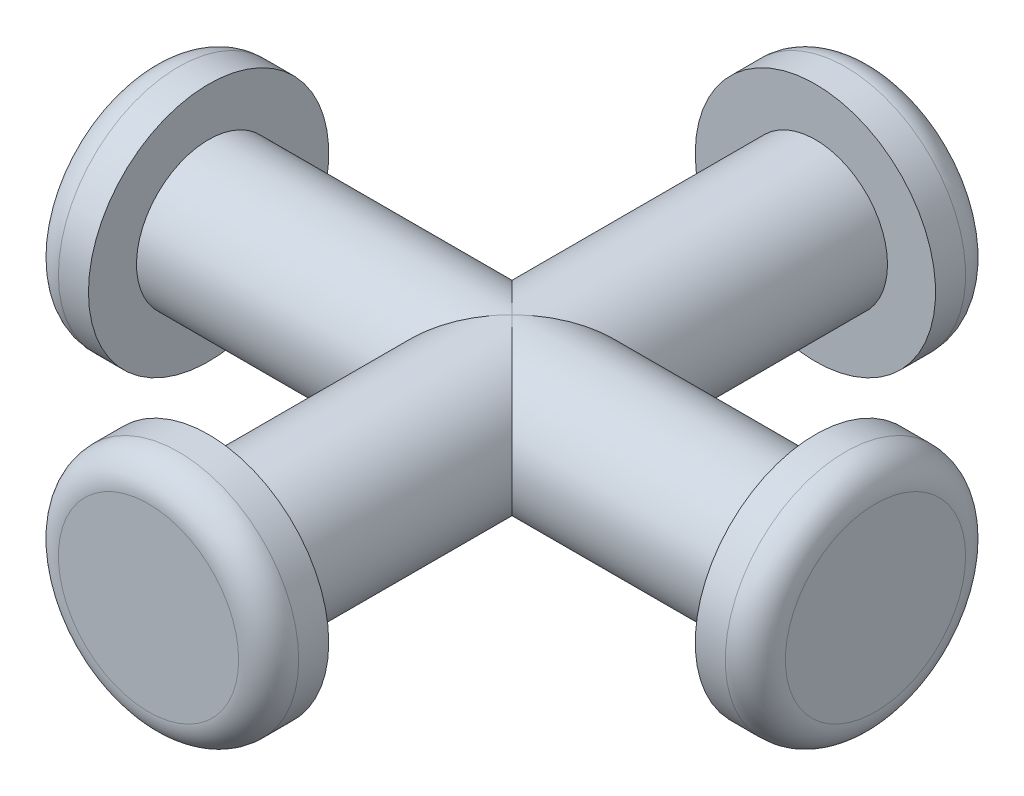
ISO-10303-21;
HEADER;
FILE_DESCRIPTION(('STEP AP214'),'2;1');
FILE_NAME('part.step','',(''),(''),'','','');
FILE_SCHEMA(('AUTOMOTIVE_DESIGN { 1 0 10303 214 1 1 1 1 }'));
ENDSEC;
DATA;
#1=APPLICATION_CONTEXT('core data for automotive mechanical design processes');
#2=APPLICATION_PROTOCOL_DEFINITION('international standard','automotive_design',2000,#1);
#3=PRODUCT_CONTEXT('',#1,'mechanical');
#4=PRODUCT('Part','Part','',(#3));
#5=PRODUCT_RELATED_PRODUCT_CATEGORY('part','',(#4));
#6=PRODUCT_DEFINITION_FORMATION('','',#4);
#7=PRODUCT_DEFINITION_CONTEXT('part definition',#1,'design');
#8=PRODUCT_DEFINITION('design','',#6,#7);
#9=PRODUCT_DEFINITION_SHAPE('','',#8);
#10=(LENGTH_UNIT() NAMED_UNIT(*) SI_UNIT(.MILLI.,.METRE.));
#11=(NAMED_UNIT(*) PLANE_ANGLE_UNIT() SI_UNIT($,.RADIAN.));
#12=(NAMED_UNIT(*) SI_UNIT($,.STERADIAN.) SOLID_ANGLE_UNIT());
#13=UNCERTAINTY_MEASURE_WITH_UNIT(LENGTH_MEASURE(1.E-05),#10,'distance_accuracy_value','');
#14=(GEOMETRIC_REPRESENTATION_CONTEXT(3) GLOBAL_UNCERTAINTY_ASSIGNED_CONTEXT((#13)) GLOBAL_UNIT_ASSIGNED_CONTEXT((#10,
#11,#12)) REPRESENTATION_CONTEXT('',''));
#15=CARTESIAN_POINT('',(0.,0.,0.));
#16=DIRECTION('',(0.,0.,1.));
#17=DIRECTION('',(1.,0.,0.));
#18=AXIS2_PLACEMENT_3D('',#15,#16,#17);
#19=CARTESIAN_POINT('',(0.,0.,10.1));
#20=DIRECTION('',(0.,0.,-1.));
#21=DIRECTION('',(-1.,0.,0.));
#22=AXIS2_PLACEMENT_3D('',#19,#20,#21);
#23=CYLINDRICAL_SURFACE('',#22,2.4);
#24=CARTESIAN_POINT('',(0.,0.,10.1));
#25=DIRECTION('',(0.,0.,1.));
#26=DIRECTION('',(1.,0.,0.));
#27=AXIS2_PLACEMENT_3D('',#24,#25,#26);
#28=CIRCLE('',#27,2.4);
#29=CARTESIAN_POINT('',(2.4,0.,10.1));
#30=VERTEX_POINT('',#29);
#31=EDGE_CURVE('E63',#30,#30,#28,.T.);
#32=ORIENTED_EDGE('',*,*,#31,.F.);
#33=EDGE_LOOP('',(#32));
#34=FACE_BOUND('',#33,.T.);
#35=CARTESIAN_POINT('',(0.,0.,0.));
#36=DIRECTION('',(-0.707106781186547,0.,-0.707106781186547));
#37=DIRECTION('',(0.707106781186547,0.,-0.707106781186547));
#38=AXIS2_PLACEMENT_3D('',#35,#36,#37);
#39=ELLIPSE('',#38,3.39411254969543,2.4);
#40=CARTESIAN_POINT('',(0.,-2.4,0.));
#41=VERTEX_POINT('',#40);
#42=CARTESIAN_POINT('',(0.,2.4,0.));
#43=VERTEX_POINT('',#42);
#44=EDGE_CURVE('E56',#41,#43,#39,.T.);
#45=ORIENTED_EDGE('',*,*,#44,.F.);
#46=CARTESIAN_POINT('',(0.,0.,0.));
#47=DIRECTION('',(0.707106781186547,0.,-0.707106781186547));
#48=DIRECTION('',(-0.707106781186547,0.,-0.707106781186547));
#49=AXIS2_PLACEMENT_3D('',#46,#47,#48);
#50=ELLIPSE('',#49,3.39411254969543,2.4);
#51=EDGE_CURVE('E55',#43,#41,#50,.T.);
#52=ORIENTED_EDGE('',*,*,#51,.F.);
#53=EDGE_LOOP('',(#45,#52));
#54=FACE_BOUND('',#53,.T.);
#55=ADVANCED_FACE('F35',(#34,#54),#23,.T.);
#56=CARTESIAN_POINT('',(10.1,0.,0.));
#57=DIRECTION('',(-1.,0.,0.));
#58=DIRECTION('',(0.,0.,1.));
#59=AXIS2_PLACEMENT_3D('',#56,#57,#58);
#60=CYLINDRICAL_SURFACE('',#59,2.4);
#61=CARTESIAN_POINT('',(-10.1,0.,0.));
#62=DIRECTION('',(1.,0.,0.));
#63=DIRECTION('',(0.,0.,-1.));
#64=AXIS2_PLACEMENT_3D('',#61,#62,#63);
#65=CIRCLE('',#64,2.4);
#66=CARTESIAN_POINT('',(-10.1,0.,-2.4));
#67=VERTEX_POINT('',#66);
#68=EDGE_CURVE('E134',#67,#67,#65,.T.);
#69=ORIENTED_EDGE('',*,*,#68,.T.);
#70=EDGE_LOOP('',(#69));
#71=FACE_BOUND('',#70,.T.);
#72=CARTESIAN_POINT('',(0.,0.,0.));
#73=DIRECTION('',(0.707106781186547,0.,-0.707106781186547));
#74=DIRECTION('',(-0.707106781186547,0.,-0.707106781186547));
#75=AXIS2_PLACEMENT_3D('',#72,#73,#74);
#76=ELLIPSE('',#75,3.39411254969543,2.4);
#77=EDGE_CURVE('E49',#43,#41,#76,.F.);
#78=ORIENTED_EDGE('',*,*,#77,.T.);
#79=ORIENTED_EDGE('',*,*,#44,.T.);
#80=EDGE_LOOP('',(#78,#79));
#81=FACE_BOUND('',#80,.T.);
#82=ADVANCED_FACE('F65',(#71,#81),#60,.T.);
#83=CARTESIAN_POINT('',(0.,0.,-10.1));
#84=DIRECTION('',(0.,0.,1.));
#85=DIRECTION('',(1.,0.,0.));
#86=AXIS2_PLACEMENT_3D('',#83,#84,#85);
#87=CIRCLE('',#86,2.4);
#88=CARTESIAN_POINT('',(2.4,0.,-10.1));
#89=VERTEX_POINT('',#88);
#90=EDGE_CURVE('E120',#89,#89,#87,.T.);
#91=ORIENTED_EDGE('',*,*,#90,.T.);
#92=EDGE_LOOP('',(#91));
#93=FACE_BOUND('',#92,.T.);
#94=CARTESIAN_POINT('',(0.,0.,0.));
#95=DIRECTION('',(-0.707106781186547,0.,-0.707106781186547));
#96=DIRECTION('',(0.707106781186547,0.,-0.707106781186547));
#97=AXIS2_PLACEMENT_3D('',#94,#95,#96);
#98=ELLIPSE('',#97,3.39411254969543,2.4);
#99=EDGE_CURVE('E62',#41,#43,#98,.F.);
#100=ORIENTED_EDGE('',*,*,#99,.F.);
#101=ORIENTED_EDGE('',*,*,#77,.F.);
#102=EDGE_LOOP('',(#100,#101));
#103=FACE_BOUND('',#102,.T.);
#104=ADVANCED_FACE('F61',(#93,#103),#23,.T.);
#105=CARTESIAN_POINT('',(10.1,0.,0.));
#106=DIRECTION('',(1.,0.,0.));
#107=DIRECTION('',(0.,0.,-1.));
#108=AXIS2_PLACEMENT_3D('',#105,#106,#107);
#109=CIRCLE('',#108,2.4);
#110=CARTESIAN_POINT('',(10.1,0.,-2.4));
#111=VERTEX_POINT('',#110);
#112=EDGE_CURVE('E133',#111,#111,#109,.T.);
#113=ORIENTED_EDGE('',*,*,#112,.F.);
#114=EDGE_LOOP('',(#113));
#115=FACE_BOUND('',#114,.T.);
#116=ORIENTED_EDGE('',*,*,#51,.T.);
#117=ORIENTED_EDGE('',*,*,#99,.T.);
#118=EDGE_LOOP('',(#116,#117));
#119=FACE_BOUND('',#118,.T.);
#120=ADVANCED_FACE('F67',(#115,#119),#60,.T.);
#121=CARTESIAN_POINT('',(12.1,0.,0.));
#122=DIRECTION('',(-1.,0.,0.));
#123=DIRECTION('',(0.,0.,1.));
#124=AXIS2_PLACEMENT_3D('',#121,#122,#123);
#125=CYLINDRICAL_SURFACE('',#124,4.);
#126=CARTESIAN_POINT('',(11.1,0.,0.));
#127=DIRECTION('',(1.,0.,0.));
#128=DIRECTION('',(0.,0.,-1.));
#129=AXIS2_PLACEMENT_3D('',#126,#127,#128);
#130=CIRCLE('',#129,4.);
#131=CARTESIAN_POINT('',(11.1,0.,-4.));
#132=VERTEX_POINT('',#131);
#133=EDGE_CURVE('E85',#132,#132,#130,.F.);
#134=ORIENTED_EDGE('',*,*,#133,.T.);
#135=EDGE_LOOP('',(#134));
#136=FACE_BOUND('',#135,.T.);
#137=CARTESIAN_POINT('',(10.1,0.,0.));
#138=DIRECTION('',(1.,0.,0.));
#139=DIRECTION('',(0.,0.,-1.));
#140=AXIS2_PLACEMENT_3D('',#137,#138,#139);
#141=CIRCLE('',#140,4.);
#142=CARTESIAN_POINT('',(10.1,0.,-4.));
#143=VERTEX_POINT('',#142);
#144=EDGE_CURVE('E137',#143,#143,#141,.T.);
#145=ORIENTED_EDGE('',*,*,#144,.T.);
#146=EDGE_LOOP('',(#145));
#147=FACE_BOUND('',#146,.T.);
#148=ADVANCED_FACE('F116',(#136,#147),#125,.T.);
#149=CARTESIAN_POINT('',(12.1,0.,0.));
#150=DIRECTION('',(1.,0.,0.));
#151=DIRECTION('',(0.,0.,-1.));
#152=AXIS2_PLACEMENT_3D('',#149,#150,#151);
#153=PLANE('',#152);
#154=CARTESIAN_POINT('',(12.1,0.,0.));
#155=DIRECTION('',(1.,0.,0.));
#156=DIRECTION('',(0.,0.,-1.));
#157=AXIS2_PLACEMENT_3D('',#154,#155,#156);
#158=CIRCLE('',#157,3.);
#159=CARTESIAN_POINT('',(12.1,0.,-3.));
#160=VERTEX_POINT('',#159);
#161=EDGE_CURVE('E82',#160,#160,#158,.T.);
#162=ORIENTED_EDGE('',*,*,#161,.T.);
#163=EDGE_LOOP('',(#162));
#164=FACE_BOUND('',#163,.T.);
#165=ADVANCED_FACE('F167',(#164),#153,.T.);
#166=CARTESIAN_POINT('',(10.1,0.,0.));
#167=DIRECTION('',(1.,0.,0.));
#168=DIRECTION('',(0.,0.,-1.));
#169=AXIS2_PLACEMENT_3D('',#166,#167,#168);
#170=PLANE('',#169);
#171=ORIENTED_EDGE('',*,*,#112,.T.);
#172=EDGE_LOOP('',(#171));
#173=FACE_BOUND('',#172,.T.);
#174=ORIENTED_EDGE('',*,*,#144,.F.);
#175=EDGE_LOOP('',(#174));
#176=FACE_BOUND('',#175,.T.);
#177=ADVANCED_FACE('F165',(#173,#176),#170,.F.);
#178=CARTESIAN_POINT('',(-12.1,0.,0.));
#179=DIRECTION('',(1.,0.,0.));
#180=DIRECTION('',(0.,0.,-1.));
#181=AXIS2_PLACEMENT_3D('',#178,#179,#180);
#182=CYLINDRICAL_SURFACE('',#181,4.);
#183=CARTESIAN_POINT('',(-11.1,0.,0.));
#184=DIRECTION('',(-1.,0.,0.));
#185=DIRECTION('',(0.,0.,1.));
#186=AXIS2_PLACEMENT_3D('',#183,#184,#185);
#187=CIRCLE('',#186,4.);
#188=CARTESIAN_POINT('',(-11.1,0.,4.));
#189=VERTEX_POINT('',#188);
#190=EDGE_CURVE('E71',#189,#189,#187,.F.);
#191=ORIENTED_EDGE('',*,*,#190,.T.);
#192=EDGE_LOOP('',(#191));
#193=FACE_BOUND('',#192,.T.);
#194=CARTESIAN_POINT('',(-10.1,0.,0.));
#195=DIRECTION('',(-1.,0.,0.));
#196=DIRECTION('',(0.,0.,1.));
#197=AXIS2_PLACEMENT_3D('',#194,#195,#196);
#198=CIRCLE('',#197,4.);
#199=CARTESIAN_POINT('',(-10.1,0.,4.));
#200=VERTEX_POINT('',#199);
#201=EDGE_CURVE('E126',#200,#200,#198,.T.);
#202=ORIENTED_EDGE('',*,*,#201,.T.);
#203=EDGE_LOOP('',(#202));
#204=FACE_BOUND('',#203,.T.);
#205=ADVANCED_FACE('F145',(#193,#204),#182,.T.);
#206=CARTESIAN_POINT('',(-12.1,0.,0.));
#207=DIRECTION('',(-1.,0.,0.));
#208=DIRECTION('',(0.,0.,1.));
#209=AXIS2_PLACEMENT_3D('',#206,#207,#208);
#210=PLANE('',#209);
#211=CARTESIAN_POINT('',(-12.1,0.,0.));
#212=DIRECTION('',(-1.,0.,0.));
#213=DIRECTION('',(0.,0.,1.));
#214=AXIS2_PLACEMENT_3D('',#211,#212,#213);
#215=CIRCLE('',#214,3.);
#216=CARTESIAN_POINT('',(-12.1,0.,3.));
#217=VERTEX_POINT('',#216);
#218=EDGE_CURVE('E68',#217,#217,#215,.T.);
#219=ORIENTED_EDGE('',*,*,#218,.T.);
#220=EDGE_LOOP('',(#219));
#221=FACE_BOUND('',#220,.T.);
#222=ADVANCED_FACE('F150',(#221),#210,.T.);
#223=CARTESIAN_POINT('',(-10.1,0.,0.));
#224=DIRECTION('',(-1.,0.,0.));
#225=DIRECTION('',(0.,0.,1.));
#226=AXIS2_PLACEMENT_3D('',#223,#224,#225);
#227=PLANE('',#226);
#228=ORIENTED_EDGE('',*,*,#68,.F.);
#229=EDGE_LOOP('',(#228));
#230=FACE_BOUND('',#229,.T.);
#231=ORIENTED_EDGE('',*,*,#201,.F.);
#232=EDGE_LOOP('',(#231));
#233=FACE_BOUND('',#232,.T.);
#234=ADVANCED_FACE('F147',(#230,#233),#227,.F.);
#235=CARTESIAN_POINT('',(0.,0.,12.1));
#236=DIRECTION('',(0.,0.,-1.));
#237=DIRECTION('',(-1.,0.,0.));
#238=AXIS2_PLACEMENT_3D('',#235,#236,#237);
#239=CYLINDRICAL_SURFACE('',#238,4.);
#240=CARTESIAN_POINT('',(0.,0.,11.1));
#241=DIRECTION('',(0.,0.,1.));
#242=DIRECTION('',(1.,0.,0.));
#243=AXIS2_PLACEMENT_3D('',#240,#241,#242);
#244=CIRCLE('',#243,4.);
#245=CARTESIAN_POINT('',(4.,0.,11.1));
#246=VERTEX_POINT('',#245);
#247=EDGE_CURVE('E11',#246,#246,#244,.F.);
#248=ORIENTED_EDGE('',*,*,#247,.T.);
#249=EDGE_LOOP('',(#248));
#250=FACE_BOUND('',#249,.T.);
#251=CARTESIAN_POINT('',(0.,0.,10.1));
#252=DIRECTION('',(0.,0.,1.));
#253=DIRECTION('',(1.,0.,0.));
#254=AXIS2_PLACEMENT_3D('',#251,#252,#253);
#255=CIRCLE('',#254,4.);
#256=CARTESIAN_POINT('',(4.,0.,10.1));
#257=VERTEX_POINT('',#256);
#258=EDGE_CURVE('E122',#257,#257,#255,.T.);
#259=ORIENTED_EDGE('',*,*,#258,.T.);
#260=EDGE_LOOP('',(#259));
#261=FACE_BOUND('',#260,.T.);
#262=ADVANCED_FACE('F149',(#250,#261),#239,.T.);
#263=CARTESIAN_POINT('',(0.,0.,12.1));
#264=DIRECTION('',(0.,0.,1.));
#265=DIRECTION('',(1.,0.,0.));
#266=AXIS2_PLACEMENT_3D('',#263,#264,#265);
#267=PLANE('',#266);
#268=CARTESIAN_POINT('',(0.,0.,12.1));
#269=DIRECTION('',(0.,0.,1.));
#270=DIRECTION('',(1.,0.,0.));
#271=AXIS2_PLACEMENT_3D('',#268,#269,#270);
#272=CIRCLE('',#271,3.);
#273=CARTESIAN_POINT('',(3.,0.,12.1));
#274=VERTEX_POINT('',#273);
#275=EDGE_CURVE('E43',#274,#274,#272,.T.);
#276=ORIENTED_EDGE('',*,*,#275,.T.);
#277=EDGE_LOOP('',(#276));
#278=FACE_BOUND('',#277,.T.);
#279=ADVANCED_FACE('F90',(#278),#267,.T.);
#280=CARTESIAN_POINT('',(0.,0.,10.1));
#281=DIRECTION('',(0.,0.,1.));
#282=DIRECTION('',(1.,0.,0.));
#283=AXIS2_PLACEMENT_3D('',#280,#281,#282);
#284=PLANE('',#283);
#285=ORIENTED_EDGE('',*,*,#31,.T.);
#286=EDGE_LOOP('',(#285));
#287=FACE_BOUND('',#286,.T.);
#288=ORIENTED_EDGE('',*,*,#258,.F.);
#289=EDGE_LOOP('',(#288));
#290=FACE_BOUND('',#289,.T.);
#291=ADVANCED_FACE('F219',(#287,#290),#284,.F.);
#292=CARTESIAN_POINT('',(0.,0.,-12.1));
#293=DIRECTION('',(0.,0.,1.));
#294=DIRECTION('',(1.,0.,0.));
#295=AXIS2_PLACEMENT_3D('',#292,#293,#294);
#296=CYLINDRICAL_SURFACE('',#295,4.);
#297=CARTESIAN_POINT('',(0.,0.,-11.1));
#298=DIRECTION('',(0.,0.,-1.));
#299=DIRECTION('',(-1.,0.,0.));
#300=AXIS2_PLACEMENT_3D('',#297,#298,#299);
#301=CIRCLE('',#300,4.);
#302=CARTESIAN_POINT('',(-4.,0.,-11.1));
#303=VERTEX_POINT('',#302);
#304=EDGE_CURVE('E79',#303,#303,#301,.F.);
#305=ORIENTED_EDGE('',*,*,#304,.T.);
#306=EDGE_LOOP('',(#305));
#307=FACE_BOUND('',#306,.T.);
#308=CARTESIAN_POINT('',(0.,0.,-10.1));
#309=DIRECTION('',(0.,0.,-1.));
#310=DIRECTION('',(-1.,0.,0.));
#311=AXIS2_PLACEMENT_3D('',#308,#309,#310);
#312=CIRCLE('',#311,4.);
#313=CARTESIAN_POINT('',(-4.,0.,-10.1));
#314=VERTEX_POINT('',#313);
#315=EDGE_CURVE('E123',#314,#314,#312,.T.);
#316=ORIENTED_EDGE('',*,*,#315,.T.);
#317=EDGE_LOOP('',(#316));
#318=FACE_BOUND('',#317,.T.);
#319=ADVANCED_FACE('F226',(#307,#318),#296,.T.);
#320=CARTESIAN_POINT('',(0.,0.,-12.1));
#321=DIRECTION('',(0.,0.,-1.));
#322=DIRECTION('',(-1.,0.,0.));
#323=AXIS2_PLACEMENT_3D('',#320,#321,#322);
#324=PLANE('',#323);
#325=CARTESIAN_POINT('',(0.,0.,-12.1));
#326=DIRECTION('',(0.,0.,-1.));
#327=DIRECTION('',(-1.,0.,0.));
#328=AXIS2_PLACEMENT_3D('',#325,#326,#327);
#329=CIRCLE('',#328,3.);
#330=CARTESIAN_POINT('',(-3.,0.,-12.1));
#331=VERTEX_POINT('',#330);
#332=EDGE_CURVE('E76',#331,#331,#329,.T.);
#333=ORIENTED_EDGE('',*,*,#332,.T.);
#334=EDGE_LOOP('',(#333));
#335=FACE_BOUND('',#334,.T.);
#336=ADVANCED_FACE('F231',(#335),#324,.T.);
#337=CARTESIAN_POINT('',(0.,0.,-10.1));
#338=DIRECTION('',(0.,0.,-1.));
#339=DIRECTION('',(-1.,0.,0.));
#340=AXIS2_PLACEMENT_3D('',#337,#338,#339);
#341=PLANE('',#340);
#342=ORIENTED_EDGE('',*,*,#90,.F.);
#343=EDGE_LOOP('',(#342));
#344=FACE_BOUND('',#343,.T.);
#345=ORIENTED_EDGE('',*,*,#315,.F.);
#346=EDGE_LOOP('',(#345));
#347=FACE_BOUND('',#346,.T.);
#348=ADVANCED_FACE('F241',(#344,#347),#341,.F.);
#349=CARTESIAN_POINT('',(-11.1,0.,0.));
#350=DIRECTION('',(-1.,0.,0.));
#351=DIRECTION('',(0.,0.,1.));
#352=AXIS2_PLACEMENT_3D('',#349,#350,#351);
#353=TOROIDAL_SURFACE('',#352,3.,1.);
#354=ORIENTED_EDGE('',*,*,#190,.F.);
#355=EDGE_LOOP('',(#354));
#356=FACE_BOUND('',#355,.T.);
#357=ORIENTED_EDGE('',*,*,#218,.F.);
#358=EDGE_LOOP('',(#357));
#359=FACE_BOUND('',#358,.T.);
#360=ADVANCED_FACE('F249',(#356,#359),#353,.T.);
#361=CARTESIAN_POINT('',(0.,0.,-11.1));
#362=DIRECTION('',(0.,0.,-1.));
#363=DIRECTION('',(-1.,0.,0.));
#364=AXIS2_PLACEMENT_3D('',#361,#362,#363);
#365=TOROIDAL_SURFACE('',#364,3.,1.);
#366=ORIENTED_EDGE('',*,*,#304,.F.);
#367=EDGE_LOOP('',(#366));
#368=FACE_BOUND('',#367,.T.);
#369=ORIENTED_EDGE('',*,*,#332,.F.);
#370=EDGE_LOOP('',(#369));
#371=FACE_BOUND('',#370,.T.);
#372=ADVANCED_FACE('F98',(#368,#371),#365,.T.);
#373=CARTESIAN_POINT('',(11.1,0.,0.));
#374=DIRECTION('',(1.,0.,0.));
#375=DIRECTION('',(0.,0.,-1.));
#376=AXIS2_PLACEMENT_3D('',#373,#374,#375);
#377=TOROIDAL_SURFACE('',#376,3.,1.);
#378=ORIENTED_EDGE('',*,*,#133,.F.);
#379=EDGE_LOOP('',(#378));
#380=FACE_BOUND('',#379,.T.);
#381=ORIENTED_EDGE('',*,*,#161,.F.);
#382=EDGE_LOOP('',(#381));
#383=FACE_BOUND('',#382,.T.);
#384=ADVANCED_FACE('F93',(#380,#383),#377,.T.);
#385=CARTESIAN_POINT('',(0.,0.,11.1));
#386=DIRECTION('',(0.,0.,1.));
#387=DIRECTION('',(1.,0.,0.));
#388=AXIS2_PLACEMENT_3D('',#385,#386,#387);
#389=TOROIDAL_SURFACE('',#388,3.,1.);
#390=ORIENTED_EDGE('',*,*,#247,.F.);
#391=EDGE_LOOP('',(#390));
#392=FACE_BOUND('',#391,.T.);
#393=ORIENTED_EDGE('',*,*,#275,.F.);
#394=EDGE_LOOP('',(#393));
#395=FACE_BOUND('',#394,.T.);
#396=ADVANCED_FACE('F37',(#392,#395),#389,.T.);
#397=CLOSED_SHELL('',(#55,#82,#104,#120,#148,#165,#177,#205,#222,#234,#262,#279,#291,#319,#336,
#348,#360,#372,#384,#396));
#398=MANIFOLD_SOLID_BREP('B2',#397);
#399=ADVANCED_BREP_SHAPE_REPRESENTATION('',(#18,#398),#14);
#400=SHAPE_DEFINITION_REPRESENTATION(#9,#399);
ENDSEC;
END-ISO-10303-21;
